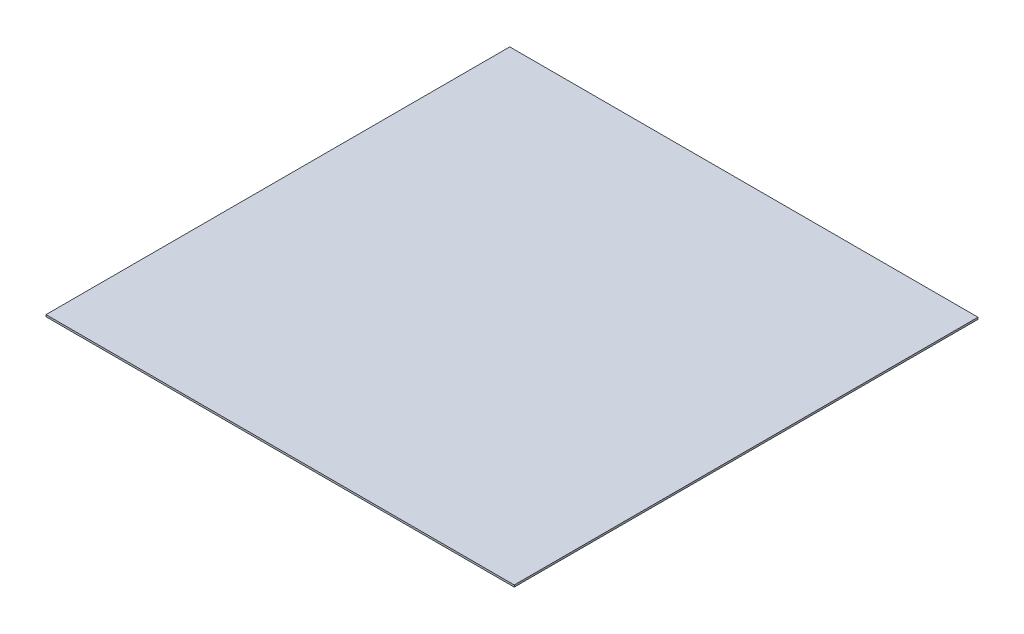
ISO-10303-21;
HEADER;
FILE_DESCRIPTION(('STEP AP214'),'2;1');
FILE_NAME('part.step','',(''),(''),'','','');
FILE_SCHEMA(('AUTOMOTIVE_DESIGN { 1 0 10303 214 1 1 1 1 }'));
ENDSEC;
DATA;
#1=APPLICATION_CONTEXT('core data for automotive mechanical design processes');
#2=APPLICATION_PROTOCOL_DEFINITION('international standard','automotive_design',2000,#1);
#3=PRODUCT_CONTEXT('',#1,'mechanical');
#4=PRODUCT('Part','Part','',(#3));
#5=PRODUCT_RELATED_PRODUCT_CATEGORY('part','',(#4));
#6=PRODUCT_DEFINITION_FORMATION('','',#4);
#7=PRODUCT_DEFINITION_CONTEXT('part definition',#1,'design');
#8=PRODUCT_DEFINITION('design','',#6,#7);
#9=PRODUCT_DEFINITION_SHAPE('','',#8);
#10=(LENGTH_UNIT() NAMED_UNIT(*) SI_UNIT(.MILLI.,.METRE.));
#11=(NAMED_UNIT(*) PLANE_ANGLE_UNIT() SI_UNIT($,.RADIAN.));
#12=(NAMED_UNIT(*) SI_UNIT($,.STERADIAN.) SOLID_ANGLE_UNIT());
#13=UNCERTAINTY_MEASURE_WITH_UNIT(LENGTH_MEASURE(1.E-05),#10,'distance_accuracy_value','');
#14=(GEOMETRIC_REPRESENTATION_CONTEXT(3) GLOBAL_UNCERTAINTY_ASSIGNED_CONTEXT((#13)) GLOBAL_UNIT_ASSIGNED_CONTEXT((#10,
#11,#12)) REPRESENTATION_CONTEXT('',''));
#15=CARTESIAN_POINT('',(0.,0.,0.));
#16=DIRECTION('',(0.,0.,1.));
#17=DIRECTION('',(1.,0.,0.));
#18=AXIS2_PLACEMENT_3D('',#15,#16,#17);
#19=CARTESIAN_POINT('',(196.89992,-1.5875,195.));
#20=DIRECTION('',(1.,0.,0.));
#21=DIRECTION('',(0.,0.,-1.));
#22=AXIS2_PLACEMENT_3D('',#19,#20,#21);
#23=PLANE('',#22);
#24=DIRECTION('',(0.,0.,-1.));
#25=VECTOR('',#24,1.);
#26=CARTESIAN_POINT('',(196.89992,0.,195.));
#27=LINE('',#26,#25);
#28=CARTESIAN_POINT('',(196.89992,0.,195.));
#29=VERTEX_POINT('',#28);
#30=CARTESIAN_POINT('',(196.89992,0.,-195.));
#31=VERTEX_POINT('',#30);
#32=EDGE_CURVE('E110',#29,#31,#27,.T.);
#33=ORIENTED_EDGE('',*,*,#32,.F.);
#34=DIRECTION('',(0.,1.,0.));
#35=VECTOR('',#34,1.);
#36=CARTESIAN_POINT('',(196.89992,-1.5875,195.));
#37=LINE('',#36,#35);
#38=CARTESIAN_POINT('',(196.89992,-1.5875,195.));
#39=VERTEX_POINT('',#38);
#40=EDGE_CURVE('E11',#39,#29,#37,.T.);
#41=ORIENTED_EDGE('',*,*,#40,.F.);
#42=DIRECTION('',(0.,0.,-1.));
#43=VECTOR('',#42,1.);
#44=CARTESIAN_POINT('',(196.89992,-1.5875,195.));
#45=LINE('',#44,#43);
#46=CARTESIAN_POINT('',(196.89992,-1.5875,-195.));
#47=VERTEX_POINT('',#46);
#48=EDGE_CURVE('E102',#39,#47,#45,.T.);
#49=ORIENTED_EDGE('',*,*,#48,.T.);
#50=DIRECTION('',(0.,1.,0.));
#51=VECTOR('',#50,1.);
#52=CARTESIAN_POINT('',(196.89992,-1.5875,-195.));
#53=LINE('',#52,#51);
#54=EDGE_CURVE('E46',#47,#31,#53,.T.);
#55=ORIENTED_EDGE('',*,*,#54,.T.);
#56=EDGE_LOOP('',(#33,#41,#49,#55));
#57=FACE_BOUND('',#56,.T.);
#58=ADVANCED_FACE('F43',(#57),#23,.T.);
#59=CARTESIAN_POINT('',(-196.89992,-1.5875,195.));
#60=DIRECTION('',(0.,0.,1.));
#61=DIRECTION('',(1.,0.,0.));
#62=AXIS2_PLACEMENT_3D('',#59,#60,#61);
#63=PLANE('',#62);
#64=DIRECTION('',(1.,0.,0.));
#65=VECTOR('',#64,1.);
#66=CARTESIAN_POINT('',(-196.89992,0.,195.));
#67=LINE('',#66,#65);
#68=CARTESIAN_POINT('',(-196.89992,0.,195.));
#69=VERTEX_POINT('',#68);
#70=EDGE_CURVE('E105',#69,#29,#67,.T.);
#71=ORIENTED_EDGE('',*,*,#70,.F.);
#72=DIRECTION('',(0.,1.,0.));
#73=VECTOR('',#72,1.);
#74=CARTESIAN_POINT('',(-196.89992,-1.5875,195.));
#75=LINE('',#74,#73);
#76=CARTESIAN_POINT('',(-196.89992,-1.5875,195.));
#77=VERTEX_POINT('',#76);
#78=EDGE_CURVE('E52',#77,#69,#75,.T.);
#79=ORIENTED_EDGE('',*,*,#78,.F.);
#80=DIRECTION('',(1.,0.,0.));
#81=VECTOR('',#80,1.);
#82=CARTESIAN_POINT('',(-196.89992,-1.5875,195.));
#83=LINE('',#82,#81);
#84=EDGE_CURVE('E98',#77,#39,#83,.T.);
#85=ORIENTED_EDGE('',*,*,#84,.T.);
#86=ORIENTED_EDGE('',*,*,#40,.T.);
#87=EDGE_LOOP('',(#71,#79,#85,#86));
#88=FACE_BOUND('',#87,.T.);
#89=ADVANCED_FACE('F121',(#88),#63,.T.);
#90=CARTESIAN_POINT('',(-196.89992,-1.5875,195.));
#91=DIRECTION('',(-1.,0.,0.));
#92=DIRECTION('',(0.,0.,1.));
#93=AXIS2_PLACEMENT_3D('',#90,#91,#92);
#94=PLANE('',#93);
#95=DIRECTION('',(0.,0.,1.));
#96=VECTOR('',#95,1.);
#97=CARTESIAN_POINT('',(-196.89992,0.,195.));
#98=LINE('',#97,#96);
#99=CARTESIAN_POINT('',(-196.89992,0.,-195.));
#100=VERTEX_POINT('',#99);
#101=EDGE_CURVE('E93',#100,#69,#98,.T.);
#102=ORIENTED_EDGE('',*,*,#101,.F.);
#103=DIRECTION('',(0.,1.,0.));
#104=VECTOR('',#103,1.);
#105=CARTESIAN_POINT('',(-196.89992,-1.5875,-195.));
#106=LINE('',#105,#104);
#107=CARTESIAN_POINT('',(-196.89992,-1.5875,-195.));
#108=VERTEX_POINT('',#107);
#109=EDGE_CURVE('E88',#108,#100,#106,.T.);
#110=ORIENTED_EDGE('',*,*,#109,.F.);
#111=DIRECTION('',(0.,0.,1.));
#112=VECTOR('',#111,1.);
#113=CARTESIAN_POINT('',(-196.89992,-1.5875,195.));
#114=LINE('',#113,#112);
#115=EDGE_CURVE('E91',#108,#77,#114,.T.);
#116=ORIENTED_EDGE('',*,*,#115,.T.);
#117=ORIENTED_EDGE('',*,*,#78,.T.);
#118=EDGE_LOOP('',(#102,#110,#116,#117));
#119=FACE_BOUND('',#118,.T.);
#120=ADVANCED_FACE('F90',(#119),#94,.T.);
#121=CARTESIAN_POINT('',(-196.89992,-1.5875,-195.));
#122=DIRECTION('',(0.,0.,-1.));
#123=DIRECTION('',(-1.,0.,0.));
#124=AXIS2_PLACEMENT_3D('',#121,#122,#123);
#125=PLANE('',#124);
#126=DIRECTION('',(-1.,0.,0.));
#127=VECTOR('',#126,1.);
#128=CARTESIAN_POINT('',(-196.89992,0.,-195.));
#129=LINE('',#128,#127);
#130=EDGE_CURVE('E113',#31,#100,#129,.T.);
#131=ORIENTED_EDGE('',*,*,#130,.F.);
#132=ORIENTED_EDGE('',*,*,#54,.F.);
#133=DIRECTION('',(-1.,0.,0.));
#134=VECTOR('',#133,1.);
#135=CARTESIAN_POINT('',(-196.89992,-1.5875,-195.));
#136=LINE('',#135,#134);
#137=EDGE_CURVE('E97',#47,#108,#136,.T.);
#138=ORIENTED_EDGE('',*,*,#137,.T.);
#139=ORIENTED_EDGE('',*,*,#109,.T.);
#140=EDGE_LOOP('',(#131,#132,#138,#139));
#141=FACE_BOUND('',#140,.T.);
#142=ADVANCED_FACE('F100',(#141),#125,.T.);
#143=CARTESIAN_POINT('',(0.,-1.5875,0.));
#144=DIRECTION('',(0.,-1.,0.));
#145=DIRECTION('',(0.,0.,-1.));
#146=AXIS2_PLACEMENT_3D('',#143,#144,#145);
#147=PLANE('',#146);
#148=ORIENTED_EDGE('',*,*,#48,.F.);
#149=ORIENTED_EDGE('',*,*,#84,.F.);
#150=ORIENTED_EDGE('',*,*,#115,.F.);
#151=ORIENTED_EDGE('',*,*,#137,.F.);
#152=EDGE_LOOP('',(#148,#149,#150,#151));
#153=FACE_BOUND('',#152,.T.);
#154=ADVANCED_FACE('F96',(#153),#147,.T.);
#155=CARTESIAN_POINT('',(0.,0.,0.));
#156=DIRECTION('',(0.,-1.,0.));
#157=DIRECTION('',(0.,0.,-1.));
#158=AXIS2_PLACEMENT_3D('',#155,#156,#157);
#159=PLANE('',#158);
#160=ORIENTED_EDGE('',*,*,#32,.T.);
#161=ORIENTED_EDGE('',*,*,#130,.T.);
#162=ORIENTED_EDGE('',*,*,#101,.T.);
#163=ORIENTED_EDGE('',*,*,#70,.T.);
#164=EDGE_LOOP('',(#160,#161,#162,#163));
#165=FACE_BOUND('',#164,.T.);
#166=ADVANCED_FACE('F120',(#165),#159,.F.);
#167=CLOSED_SHELL('',(#58,#89,#120,#142,#154,#166));
#168=MANIFOLD_SOLID_BREP('B2',#167);
#169=ADVANCED_BREP_SHAPE_REPRESENTATION('',(#18,#168),#14);
#170=SHAPE_DEFINITION_REPRESENTATION(#9,#169);
ENDSEC;
END-ISO-10303-21;
